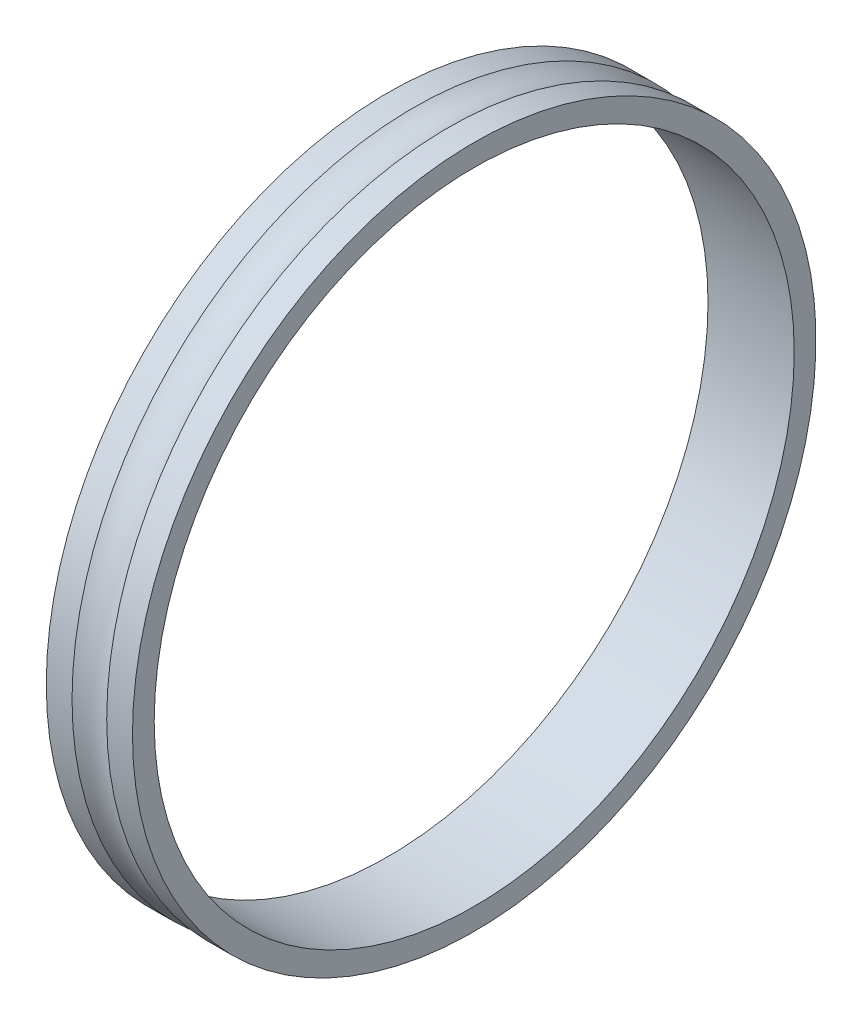
ISO-10303-21;
HEADER;
FILE_DESCRIPTION(('STEP AP214'),'2;1');
FILE_NAME('part.step','',(''),(''),'','','');
FILE_SCHEMA(('AUTOMOTIVE_DESIGN { 1 0 10303 214 1 1 1 1 }'));
ENDSEC;
DATA;
#1=APPLICATION_CONTEXT('core data for automotive mechanical design processes');
#2=APPLICATION_PROTOCOL_DEFINITION('international standard','automotive_design',2000,#1);
#3=PRODUCT_CONTEXT('',#1,'mechanical');
#4=PRODUCT('Part','Part','',(#3));
#5=PRODUCT_RELATED_PRODUCT_CATEGORY('part','',(#4));
#6=PRODUCT_DEFINITION_FORMATION('','',#4);
#7=PRODUCT_DEFINITION_CONTEXT('part definition',#1,'design');
#8=PRODUCT_DEFINITION('design','',#6,#7);
#9=PRODUCT_DEFINITION_SHAPE('','',#8);
#10=(LENGTH_UNIT() NAMED_UNIT(*) SI_UNIT(.MILLI.,.METRE.));
#11=(NAMED_UNIT(*) PLANE_ANGLE_UNIT() SI_UNIT($,.RADIAN.));
#12=(NAMED_UNIT(*) SI_UNIT($,.STERADIAN.) SOLID_ANGLE_UNIT());
#13=UNCERTAINTY_MEASURE_WITH_UNIT(LENGTH_MEASURE(1.E-05),#10,'distance_accuracy_value','');
#14=(GEOMETRIC_REPRESENTATION_CONTEXT(3) GLOBAL_UNCERTAINTY_ASSIGNED_CONTEXT((#13)) GLOBAL_UNIT_ASSIGNED_CONTEXT((#10,
#11,#12)) REPRESENTATION_CONTEXT('',''));
#15=CARTESIAN_POINT('',(0.,0.,0.));
#16=DIRECTION('',(0.,0.,1.));
#17=DIRECTION('',(1.,0.,0.));
#18=AXIS2_PLACEMENT_3D('',#15,#16,#17);
#19=CARTESIAN_POINT('',(67.76,0.,0.));
#20=DIRECTION('',(1.,0.,0.));
#21=DIRECTION('',(0.,0.,-1.));
#22=AXIS2_PLACEMENT_3D('',#19,#20,#21);
#23=TOROIDAL_SURFACE('',#22,69.3475,7.15);
#24=CARTESIAN_POINT('',(70.9528817312892,0.,0.));
#25=DIRECTION('',(-1.,0.,0.));
#26=DIRECTION('',(0.,0.,1.));
#27=AXIS2_PLACEMENT_3D('',#24,#25,#26);
#28=CIRCLE('',#27,62.95);
#29=CARTESIAN_POINT('',(70.9528817312892,0.,62.95));
#30=VERTEX_POINT('',#29);
#31=EDGE_CURVE('E31',#30,#30,#28,.F.);
#32=ORIENTED_EDGE('',*,*,#31,.F.);
#33=EDGE_LOOP('',(#32));
#34=FACE_BOUND('',#33,.T.);
#35=CARTESIAN_POINT('',(64.5671182687108,0.,0.));
#36=DIRECTION('',(-1.,0.,0.));
#37=DIRECTION('',(0.,0.,1.));
#38=AXIS2_PLACEMENT_3D('',#35,#36,#37);
#39=CIRCLE('',#38,62.95);
#40=CARTESIAN_POINT('',(64.5671182687108,0.,62.95));
#41=VERTEX_POINT('',#40);
#42=EDGE_CURVE('E36',#41,#41,#39,.T.);
#43=ORIENTED_EDGE('',*,*,#42,.F.);
#44=EDGE_LOOP('',(#43));
#45=FACE_BOUND('',#44,.T.);
#46=ADVANCED_FACE('F15',(#34,#45),#23,.F.);
#47=CARTESIAN_POINT('',(67.76,0.,0.));
#48=DIRECTION('',(-1.,0.,0.));
#49=DIRECTION('',(0.,0.,1.));
#50=AXIS2_PLACEMENT_3D('',#47,#48,#49);
#51=CYLINDRICAL_SURFACE('',#50,62.95);
#52=CARTESIAN_POINT('',(75.7,0.,0.));
#53=DIRECTION('',(-1.,0.,0.));
#54=DIRECTION('',(0.,0.,1.));
#55=AXIS2_PLACEMENT_3D('',#52,#53,#54);
#56=CIRCLE('',#55,62.95);
#57=CARTESIAN_POINT('',(75.7,0.,62.95));
#58=VERTEX_POINT('',#57);
#59=EDGE_CURVE('E19',#58,#58,#56,.F.);
#60=ORIENTED_EDGE('',*,*,#59,.F.);
#61=EDGE_LOOP('',(#60));
#62=FACE_BOUND('',#61,.T.);
#63=ORIENTED_EDGE('',*,*,#31,.T.);
#64=EDGE_LOOP('',(#63));
#65=FACE_BOUND('',#64,.T.);
#66=ADVANCED_FACE('F47',(#62,#65),#51,.T.);
#67=CARTESIAN_POINT('',(67.76,0.,0.));
#68=DIRECTION('',(-1.,0.,0.));
#69=DIRECTION('',(0.,0.,1.));
#70=AXIS2_PLACEMENT_3D('',#67,#68,#69);
#71=CYLINDRICAL_SURFACE('',#70,62.95);
#72=ORIENTED_EDGE('',*,*,#42,.T.);
#73=EDGE_LOOP('',(#72));
#74=FACE_BOUND('',#73,.T.);
#75=CARTESIAN_POINT('',(59.82,0.,0.));
#76=DIRECTION('',(-1.,0.,0.));
#77=DIRECTION('',(0.,0.,1.));
#78=AXIS2_PLACEMENT_3D('',#75,#76,#77);
#79=CIRCLE('',#78,62.95);
#80=CARTESIAN_POINT('',(59.82,0.,62.95));
#81=VERTEX_POINT('',#80);
#82=EDGE_CURVE('E28',#81,#81,#79,.T.);
#83=ORIENTED_EDGE('',*,*,#82,.F.);
#84=EDGE_LOOP('',(#83));
#85=FACE_BOUND('',#84,.T.);
#86=ADVANCED_FACE('F55',(#74,#85),#71,.T.);
#87=CARTESIAN_POINT('',(75.7,0.,60.95));
#88=DIRECTION('',(1.,0.,0.));
#89=DIRECTION('',(0.,0.,-1.));
#90=AXIS2_PLACEMENT_3D('',#87,#88,#89);
#91=PLANE('',#90);
#92=ORIENTED_EDGE('',*,*,#59,.T.);
#93=EDGE_LOOP('',(#92));
#94=FACE_BOUND('',#93,.T.);
#95=CARTESIAN_POINT('',(75.7,0.,0.));
#96=DIRECTION('',(-1.,0.,0.));
#97=DIRECTION('',(0.,0.,1.));
#98=AXIS2_PLACEMENT_3D('',#95,#96,#97);
#99=CIRCLE('',#98,58.95);
#100=CARTESIAN_POINT('',(75.7,0.,58.95));
#101=VERTEX_POINT('',#100);
#102=EDGE_CURVE('E23',#101,#101,#99,.T.);
#103=ORIENTED_EDGE('',*,*,#102,.T.);
#104=EDGE_LOOP('',(#103));
#105=FACE_BOUND('',#104,.T.);
#106=ADVANCED_FACE('F65',(#94,#105),#91,.T.);
#107=CARTESIAN_POINT('',(59.82,0.,60.95));
#108=DIRECTION('',(-1.,0.,0.));
#109=DIRECTION('',(0.,0.,1.));
#110=AXIS2_PLACEMENT_3D('',#107,#108,#109);
#111=PLANE('',#110);
#112=CARTESIAN_POINT('',(59.82,0.,0.));
#113=DIRECTION('',(-1.,0.,0.));
#114=DIRECTION('',(0.,0.,1.));
#115=AXIS2_PLACEMENT_3D('',#112,#113,#114);
#116=CIRCLE('',#115,58.95);
#117=CARTESIAN_POINT('',(59.82,0.,58.95));
#118=VERTEX_POINT('',#117);
#119=EDGE_CURVE('E10',#118,#118,#116,.F.);
#120=ORIENTED_EDGE('',*,*,#119,.T.);
#121=EDGE_LOOP('',(#120));
#122=FACE_BOUND('',#121,.T.);
#123=ORIENTED_EDGE('',*,*,#82,.T.);
#124=EDGE_LOOP('',(#123));
#125=FACE_BOUND('',#124,.T.);
#126=ADVANCED_FACE('F59',(#122,#125),#111,.T.);
#127=CARTESIAN_POINT('',(67.76,0.,0.));
#128=DIRECTION('',(-1.,0.,0.));
#129=DIRECTION('',(0.,0.,1.));
#130=AXIS2_PLACEMENT_3D('',#127,#128,#129);
#131=CYLINDRICAL_SURFACE('',#130,58.95);
#132=ORIENTED_EDGE('',*,*,#119,.F.);
#133=EDGE_LOOP('',(#132));
#134=FACE_BOUND('',#133,.T.);
#135=ORIENTED_EDGE('',*,*,#102,.F.);
#136=EDGE_LOOP('',(#135));
#137=FACE_BOUND('',#136,.T.);
#138=ADVANCED_FACE('F57',(#134,#137),#131,.F.);
#139=CLOSED_SHELL('',(#46,#66,#86,#106,#126,#138));
#140=MANIFOLD_SOLID_BREP('B1',#139);
#141=ADVANCED_BREP_SHAPE_REPRESENTATION('',(#18,#140),#14);
#142=SHAPE_DEFINITION_REPRESENTATION(#9,#141);
ENDSEC;
END-ISO-10303-21;
